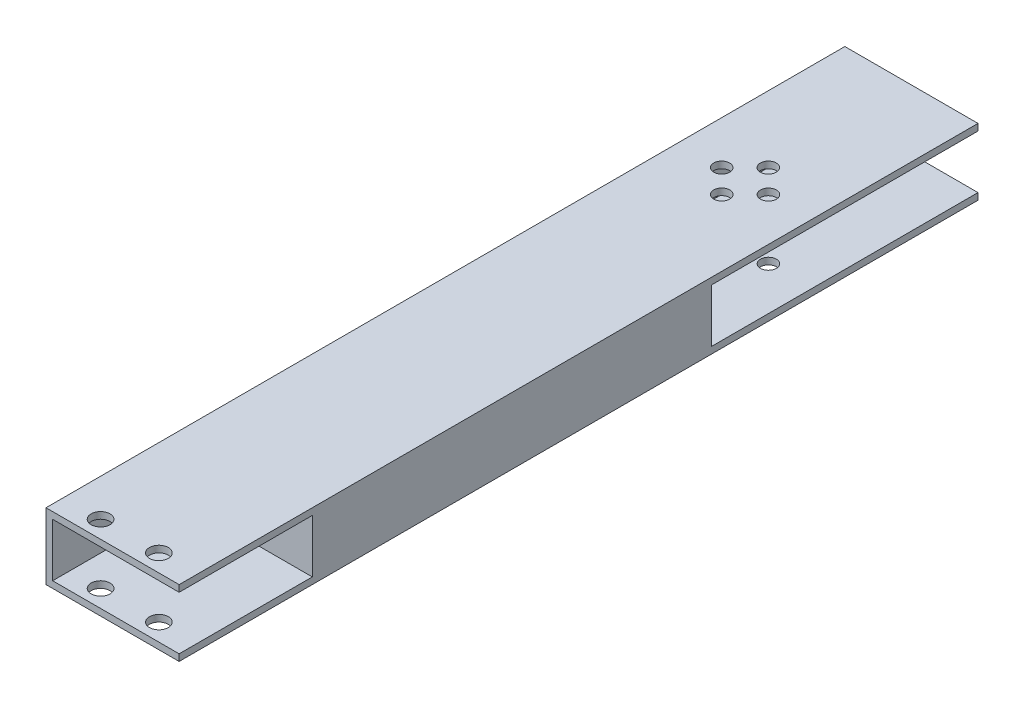
ISO-10303-21;
HEADER;
FILE_DESCRIPTION(('STEP AP214'),'2;1');
FILE_NAME('part.step','',(''),(''),'','','');
FILE_SCHEMA(('AUTOMOTIVE_DESIGN { 1 0 10303 214 1 1 1 1 }'));
ENDSEC;
DATA;
#1=APPLICATION_CONTEXT('core data for automotive mechanical design processes');
#2=APPLICATION_PROTOCOL_DEFINITION('international standard','automotive_design',2000,#1);
#3=PRODUCT_CONTEXT('',#1,'mechanical');
#4=PRODUCT('Part','Part','',(#3));
#5=PRODUCT_RELATED_PRODUCT_CATEGORY('part','',(#4));
#6=PRODUCT_DEFINITION_FORMATION('','',#4);
#7=PRODUCT_DEFINITION_CONTEXT('part definition',#1,'design');
#8=PRODUCT_DEFINITION('design','',#6,#7);
#9=PRODUCT_DEFINITION_SHAPE('','',#8);
#10=(LENGTH_UNIT() NAMED_UNIT(*) SI_UNIT(.MILLI.,.METRE.));
#11=(NAMED_UNIT(*) PLANE_ANGLE_UNIT() SI_UNIT($,.RADIAN.));
#12=(NAMED_UNIT(*) SI_UNIT($,.STERADIAN.) SOLID_ANGLE_UNIT());
#13=UNCERTAINTY_MEASURE_WITH_UNIT(LENGTH_MEASURE(1.E-05),#10,'distance_accuracy_value','');
#14=(GEOMETRIC_REPRESENTATION_CONTEXT(3) GLOBAL_UNCERTAINTY_ASSIGNED_CONTEXT((#13)) GLOBAL_UNIT_ASSIGNED_CONTEXT((#10,
#11,#12)) REPRESENTATION_CONTEXT('',''));
#15=CARTESIAN_POINT('',(0.,0.,0.));
#16=DIRECTION('',(0.,0.,1.));
#17=DIRECTION('',(1.,0.,0.));
#18=AXIS2_PLACEMENT_3D('',#15,#16,#17);
#19=CARTESIAN_POINT('',(11.43,5.08,127.));
#20=DIRECTION('',(0.,1.,0.));
#21=DIRECTION('',(0.,0.,1.));
#22=AXIS2_PLACEMENT_3D('',#19,#20,#21);
#23=PLANE('',#22);
#24=CARTESIAN_POINT('',(-4.445,5.08,6.35));
#25=DIRECTION('',(0.,1.,0.));
#26=DIRECTION('',(0.,0.,1.));
#27=AXIS2_PLACEMENT_3D('',#24,#25,#26);
#28=CIRCLE('',#27,1.524);
#29=CARTESIAN_POINT('',(-4.445,5.08,7.874));
#30=VERTEX_POINT('',#29);
#31=EDGE_CURVE('E237',#30,#30,#28,.T.);
#32=ORIENTED_EDGE('',*,*,#31,.T.);
#33=EDGE_LOOP('',(#32));
#34=FACE_BOUND('',#33,.T.);
#35=CARTESIAN_POINT('',(0.,5.08,10.795));
#36=DIRECTION('',(0.,1.,0.));
#37=DIRECTION('',(0.,0.,1.));
#38=AXIS2_PLACEMENT_3D('',#35,#36,#37);
#39=CIRCLE('',#38,1.524);
#40=CARTESIAN_POINT('',(0.,5.08,12.319));
#41=VERTEX_POINT('',#40);
#42=EDGE_CURVE('E242',#41,#41,#39,.T.);
#43=ORIENTED_EDGE('',*,*,#42,.T.);
#44=EDGE_LOOP('',(#43));
#45=FACE_BOUND('',#44,.T.);
#46=CARTESIAN_POINT('',(4.4704,5.08,6.35));
#47=DIRECTION('',(0.,1.,0.));
#48=DIRECTION('',(0.,0.,1.));
#49=AXIS2_PLACEMENT_3D('',#46,#47,#48);
#50=CIRCLE('',#49,1.524);
#51=CARTESIAN_POINT('',(4.4704,5.08,7.874));
#52=VERTEX_POINT('',#51);
#53=EDGE_CURVE('E247',#52,#52,#50,.T.);
#54=ORIENTED_EDGE('',*,*,#53,.T.);
#55=EDGE_LOOP('',(#54));
#56=FACE_BOUND('',#55,.T.);
#57=CARTESIAN_POINT('',(0.,5.08,1.905));
#58=DIRECTION('',(0.,1.,0.));
#59=DIRECTION('',(0.,0.,1.));
#60=AXIS2_PLACEMENT_3D('',#57,#58,#59);
#61=CIRCLE('',#60,1.524);
#62=CARTESIAN_POINT('',(0.,5.08,3.429));
#63=VERTEX_POINT('',#62);
#64=EDGE_CURVE('E251',#63,#63,#61,.T.);
#65=ORIENTED_EDGE('',*,*,#64,.T.);
#66=EDGE_LOOP('',(#65));
#67=FACE_BOUND('',#66,.T.);
#68=DIRECTION('',(1.,0.,0.));
#69=VECTOR('',#68,1.);
#70=CARTESIAN_POINT('',(-11.43,5.08,25.4));
#71=LINE('',#70,#69);
#72=CARTESIAN_POINT('',(-11.43,5.08,25.4));
#73=VERTEX_POINT('',#72);
#74=CARTESIAN_POINT('',(12.7,5.08,25.4));
#75=VERTEX_POINT('',#74);
#76=EDGE_CURVE('E158',#73,#75,#71,.T.);
#77=ORIENTED_EDGE('',*,*,#76,.F.);
#78=DIRECTION('',(0.,0.,-1.));
#79=VECTOR('',#78,1.);
#80=CARTESIAN_POINT('',(-11.43,5.08,127.));
#81=LINE('',#80,#79);
#82=CARTESIAN_POINT('',(-11.43,5.08,-25.4));
#83=VERTEX_POINT('',#82);
#84=EDGE_CURVE('E154',#73,#83,#81,.T.);
#85=ORIENTED_EDGE('',*,*,#84,.T.);
#86=DIRECTION('',(1.,0.,0.));
#87=VECTOR('',#86,1.);
#88=CARTESIAN_POINT('',(11.43,5.08,-25.4));
#89=LINE('',#88,#87);
#90=CARTESIAN_POINT('',(12.7,5.08,-25.4));
#91=VERTEX_POINT('',#90);
#92=EDGE_CURVE('E184',#83,#91,#89,.T.);
#93=ORIENTED_EDGE('',*,*,#92,.T.);
#94=DIRECTION('',(0.,0.,-1.));
#95=VECTOR('',#94,1.);
#96=CARTESIAN_POINT('',(12.7,5.08,127.001));
#97=LINE('',#96,#95);
#98=EDGE_CURVE('E61',#75,#91,#97,.T.);
#99=ORIENTED_EDGE('',*,*,#98,.F.);
#100=EDGE_LOOP('',(#77,#85,#93,#99));
#101=FACE_BOUND('',#100,.T.);
#102=ADVANCED_FACE('F43',(#34,#45,#56,#67,#101),#23,.F.);
#103=CARTESIAN_POINT('',(-11.43,5.08,127.));
#104=DIRECTION('',(-1.,0.,0.));
#105=DIRECTION('',(0.,-1.,0.));
#106=AXIS2_PLACEMENT_3D('',#103,#104,#105);
#107=PLANE('',#106);
#108=DIRECTION('',(0.,1.,0.));
#109=VECTOR('',#108,1.);
#110=CARTESIAN_POINT('',(-11.43,5.08,25.4));
#111=LINE('',#110,#109);
#112=CARTESIAN_POINT('',(-11.43,-5.08,25.4));
#113=VERTEX_POINT('',#112);
#114=EDGE_CURVE('E152',#113,#73,#111,.T.);
#115=ORIENTED_EDGE('',*,*,#114,.F.);
#116=DIRECTION('',(0.,0.,-1.));
#117=VECTOR('',#116,1.);
#118=CARTESIAN_POINT('',(-11.43,-5.08,127.));
#119=LINE('',#118,#117);
#120=CARTESIAN_POINT('',(-11.43,-5.08,-25.4));
#121=VERTEX_POINT('',#120);
#122=EDGE_CURVE('E135',#113,#121,#119,.T.);
#123=ORIENTED_EDGE('',*,*,#122,.T.);
#124=DIRECTION('',(0.,1.,0.));
#125=VECTOR('',#124,1.);
#126=CARTESIAN_POINT('',(-11.43,5.08,-25.4));
#127=LINE('',#126,#125);
#128=EDGE_CURVE('E181',#121,#83,#127,.T.);
#129=ORIENTED_EDGE('',*,*,#128,.T.);
#130=ORIENTED_EDGE('',*,*,#84,.F.);
#131=EDGE_LOOP('',(#115,#123,#129,#130));
#132=FACE_BOUND('',#131,.T.);
#133=ADVANCED_FACE('F153',(#132),#107,.F.);
#134=CARTESIAN_POINT('',(11.43,-5.08,127.));
#135=DIRECTION('',(0.,-1.,0.));
#136=DIRECTION('',(0.,0.,-1.));
#137=AXIS2_PLACEMENT_3D('',#134,#135,#136);
#138=PLANE('',#137);
#139=CARTESIAN_POINT('',(-4.445,-5.08,6.35));
#140=DIRECTION('',(0.,-1.,0.));
#141=DIRECTION('',(0.,0.,-1.));
#142=AXIS2_PLACEMENT_3D('',#139,#140,#141);
#143=CIRCLE('',#142,1.524);
#144=CARTESIAN_POINT('',(-4.445,-5.08,4.826));
#145=VERTEX_POINT('',#144);
#146=EDGE_CURVE('E209',#145,#145,#143,.T.);
#147=ORIENTED_EDGE('',*,*,#146,.T.);
#148=EDGE_LOOP('',(#147));
#149=FACE_BOUND('',#148,.T.);
#150=CARTESIAN_POINT('',(0.,-5.08,10.795));
#151=DIRECTION('',(0.,-1.,0.));
#152=DIRECTION('',(0.,0.,-1.));
#153=AXIS2_PLACEMENT_3D('',#150,#151,#152);
#154=CIRCLE('',#153,1.524);
#155=CARTESIAN_POINT('',(0.,-5.08,9.271));
#156=VERTEX_POINT('',#155);
#157=EDGE_CURVE('E241',#156,#156,#154,.T.);
#158=ORIENTED_EDGE('',*,*,#157,.T.);
#159=EDGE_LOOP('',(#158));
#160=FACE_BOUND('',#159,.T.);
#161=CARTESIAN_POINT('',(4.4704,-5.08,6.35));
#162=DIRECTION('',(0.,-1.,0.));
#163=DIRECTION('',(0.,0.,-1.));
#164=AXIS2_PLACEMENT_3D('',#161,#162,#163);
#165=CIRCLE('',#164,1.524);
#166=CARTESIAN_POINT('',(4.4704,-5.08,4.826));
#167=VERTEX_POINT('',#166);
#168=EDGE_CURVE('E246',#167,#167,#165,.T.);
#169=ORIENTED_EDGE('',*,*,#168,.T.);
#170=EDGE_LOOP('',(#169));
#171=FACE_BOUND('',#170,.T.);
#172=CARTESIAN_POINT('',(0.,-5.08,1.905));
#173=DIRECTION('',(0.,-1.,0.));
#174=DIRECTION('',(0.,0.,-1.));
#175=AXIS2_PLACEMENT_3D('',#172,#173,#174);
#176=CIRCLE('',#175,1.524);
#177=CARTESIAN_POINT('',(0.,-5.08,0.381000000000001));
#178=VERTEX_POINT('',#177);
#179=EDGE_CURVE('E47',#178,#178,#176,.T.);
#180=ORIENTED_EDGE('',*,*,#179,.T.);
#181=EDGE_LOOP('',(#180));
#182=FACE_BOUND('',#181,.T.);
#183=DIRECTION('',(-1.,0.,0.));
#184=VECTOR('',#183,1.);
#185=CARTESIAN_POINT('',(-11.43,-5.08,25.4));
#186=LINE('',#185,#184);
#187=CARTESIAN_POINT('',(12.7,-5.08,25.4));
#188=VERTEX_POINT('',#187);
#189=EDGE_CURVE('E139',#188,#113,#186,.T.);
#190=ORIENTED_EDGE('',*,*,#189,.F.);
#191=DIRECTION('',(0.,0.,-1.));
#192=VECTOR('',#191,1.);
#193=CARTESIAN_POINT('',(12.7,-5.08,127.001));
#194=LINE('',#193,#192);
#195=CARTESIAN_POINT('',(12.7,-5.08,-25.4));
#196=VERTEX_POINT('',#195);
#197=EDGE_CURVE('E175',#188,#196,#194,.T.);
#198=ORIENTED_EDGE('',*,*,#197,.T.);
#199=DIRECTION('',(-1.,0.,0.));
#200=VECTOR('',#199,1.);
#201=CARTESIAN_POINT('',(11.43,-5.08,-25.4));
#202=LINE('',#201,#200);
#203=EDGE_CURVE('E142',#196,#121,#202,.T.);
#204=ORIENTED_EDGE('',*,*,#203,.T.);
#205=ORIENTED_EDGE('',*,*,#122,.F.);
#206=EDGE_LOOP('',(#190,#198,#204,#205));
#207=FACE_BOUND('',#206,.T.);
#208=ADVANCED_FACE('F137',(#149,#160,#171,#182,#207),#138,.F.);
#209=CARTESIAN_POINT('',(-12.7,6.35,127.));
#210=DIRECTION('',(1.,0.,0.));
#211=DIRECTION('',(0.,0.,-1.));
#212=AXIS2_PLACEMENT_3D('',#209,#210,#211);
#213=PLANE('',#212);
#214=DIRECTION('',(0.,0.,-1.));
#215=VECTOR('',#214,1.);
#216=CARTESIAN_POINT('',(-12.7,6.35,127.));
#217=LINE('',#216,#215);
#218=CARTESIAN_POINT('',(-12.7,6.35,127.));
#219=VERTEX_POINT('',#218);
#220=CARTESIAN_POINT('',(-12.7,6.35,-25.4));
#221=VERTEX_POINT('',#220);
#222=EDGE_CURVE('E311',#219,#221,#217,.T.);
#223=ORIENTED_EDGE('',*,*,#222,.T.);
#224=DIRECTION('',(0.,1.,0.));
#225=VECTOR('',#224,1.);
#226=CARTESIAN_POINT('',(-12.7,6.35,-25.4));
#227=LINE('',#226,#225);
#228=CARTESIAN_POINT('',(-12.7,-6.35,-25.4));
#229=VERTEX_POINT('',#228);
#230=EDGE_CURVE('E196',#229,#221,#227,.T.);
#231=ORIENTED_EDGE('',*,*,#230,.F.);
#232=DIRECTION('',(0.,0.,-1.));
#233=VECTOR('',#232,1.);
#234=CARTESIAN_POINT('',(-12.7,-6.35,127.));
#235=LINE('',#234,#233);
#236=CARTESIAN_POINT('',(-12.7,-6.35,127.));
#237=VERTEX_POINT('',#236);
#238=EDGE_CURVE('E11',#237,#229,#235,.T.);
#239=ORIENTED_EDGE('',*,*,#238,.F.);
#240=DIRECTION('',(0.,-1.,0.));
#241=VECTOR('',#240,1.);
#242=CARTESIAN_POINT('',(-12.7,6.35,127.));
#243=LINE('',#242,#241);
#244=EDGE_CURVE('E293',#219,#237,#243,.T.);
#245=ORIENTED_EDGE('',*,*,#244,.F.);
#246=EDGE_LOOP('',(#223,#231,#239,#245));
#247=FACE_BOUND('',#246,.T.);
#248=ADVANCED_FACE('F45',(#247),#213,.F.);
#249=CARTESIAN_POINT('',(-12.7,-6.35,127.));
#250=DIRECTION('',(0.,1.,0.));
#251=DIRECTION('',(0.,0.,1.));
#252=AXIS2_PLACEMENT_3D('',#249,#250,#251);
#253=PLANE('',#252);
#254=CARTESIAN_POINT('',(0.,-6.35,1.905));
#255=DIRECTION('',(0.,-1.,0.));
#256=DIRECTION('',(0.,0.,-1.));
#257=AXIS2_PLACEMENT_3D('',#254,#255,#256);
#258=CIRCLE('',#257,1.524);
#259=CARTESIAN_POINT('',(0.,-6.35,0.381000000000001));
#260=VERTEX_POINT('',#259);
#261=EDGE_CURVE('E210',#260,#260,#258,.T.);
#262=ORIENTED_EDGE('',*,*,#261,.F.);
#263=EDGE_LOOP('',(#262));
#264=FACE_BOUND('',#263,.T.);
#265=CARTESIAN_POINT('',(4.4704,-6.35,6.35));
#266=DIRECTION('',(0.,-1.,0.));
#267=DIRECTION('',(0.,0.,-1.));
#268=AXIS2_PLACEMENT_3D('',#265,#266,#267);
#269=CIRCLE('',#268,1.524);
#270=CARTESIAN_POINT('',(4.4704,-6.35,4.826));
#271=VERTEX_POINT('',#270);
#272=EDGE_CURVE('E214',#271,#271,#269,.T.);
#273=ORIENTED_EDGE('',*,*,#272,.F.);
#274=EDGE_LOOP('',(#273));
#275=FACE_BOUND('',#274,.T.);
#276=CARTESIAN_POINT('',(0.,-6.35,10.795));
#277=DIRECTION('',(0.,-1.,0.));
#278=DIRECTION('',(0.,0.,-1.));
#279=AXIS2_PLACEMENT_3D('',#276,#277,#278);
#280=CIRCLE('',#279,1.524);
#281=CARTESIAN_POINT('',(0.,-6.35,9.271));
#282=VERTEX_POINT('',#281);
#283=EDGE_CURVE('E222',#282,#282,#280,.T.);
#284=ORIENTED_EDGE('',*,*,#283,.F.);
#285=EDGE_LOOP('',(#284));
#286=FACE_BOUND('',#285,.T.);
#287=CARTESIAN_POINT('',(-4.445,-6.35,6.35));
#288=DIRECTION('',(0.,-1.,0.));
#289=DIRECTION('',(0.,0.,-1.));
#290=AXIS2_PLACEMENT_3D('',#287,#288,#289);
#291=CIRCLE('',#290,1.524);
#292=CARTESIAN_POINT('',(-4.445,-6.35,4.826));
#293=VERTEX_POINT('',#292);
#294=EDGE_CURVE('E230',#293,#293,#291,.T.);
#295=ORIENTED_EDGE('',*,*,#294,.F.);
#296=EDGE_LOOP('',(#295));
#297=FACE_BOUND('',#296,.T.);
#298=CARTESIAN_POINT('',(-5.588,-6.35,123.698));
#299=DIRECTION('',(0.,1.,0.));
#300=DIRECTION('',(0.,0.,1.));
#301=AXIS2_PLACEMENT_3D('',#298,#299,#300);
#302=CIRCLE('',#301,1.80339999999999);
#303=CARTESIAN_POINT('',(-5.588,-6.35,125.5014));
#304=VERTEX_POINT('',#303);
#305=EDGE_CURVE('E256',#304,#304,#302,.T.);
#306=ORIENTED_EDGE('',*,*,#305,.T.);
#307=EDGE_LOOP('',(#306));
#308=FACE_BOUND('',#307,.T.);
#309=CARTESIAN_POINT('',(5.5372,-6.35,123.698));
#310=DIRECTION('',(0.,1.,0.));
#311=DIRECTION('',(0.,0.,1.));
#312=AXIS2_PLACEMENT_3D('',#309,#310,#311);
#313=CIRCLE('',#312,1.80339999999999);
#314=CARTESIAN_POINT('',(5.5372,-6.35,125.5014));
#315=VERTEX_POINT('',#314);
#316=EDGE_CURVE('E255',#315,#315,#313,.T.);
#317=ORIENTED_EDGE('',*,*,#316,.T.);
#318=EDGE_LOOP('',(#317));
#319=FACE_BOUND('',#318,.T.);
#320=ORIENTED_EDGE('',*,*,#238,.T.);
#321=DIRECTION('',(-1.,0.,0.));
#322=VECTOR('',#321,1.);
#323=CARTESIAN_POINT('',(12.7,-6.35,-25.4));
#324=LINE('',#323,#322);
#325=CARTESIAN_POINT('',(12.7,-6.35,-25.4));
#326=VERTEX_POINT('',#325);
#327=EDGE_CURVE('E192',#326,#229,#324,.T.);
#328=ORIENTED_EDGE('',*,*,#327,.F.);
#329=DIRECTION('',(0.,0.,-1.));
#330=VECTOR('',#329,1.);
#331=CARTESIAN_POINT('',(12.7,-6.35,127.));
#332=LINE('',#331,#330);
#333=CARTESIAN_POINT('',(12.7,-6.35,127.));
#334=VERTEX_POINT('',#333);
#335=EDGE_CURVE('E53',#334,#326,#332,.T.);
#336=ORIENTED_EDGE('',*,*,#335,.F.);
#337=DIRECTION('',(1.,0.,0.));
#338=VECTOR('',#337,1.);
#339=CARTESIAN_POINT('',(-12.7,-6.35,127.));
#340=LINE('',#339,#338);
#341=EDGE_CURVE('E300',#237,#334,#340,.T.);
#342=ORIENTED_EDGE('',*,*,#341,.F.);
#343=EDGE_LOOP('',(#320,#328,#336,#342));
#344=FACE_BOUND('',#343,.T.);
#345=ADVANCED_FACE('F425',(#264,#275,#286,#297,#308,#319,#344),#253,.F.);
#346=CARTESIAN_POINT('',(12.7,6.35,127.));
#347=DIRECTION('',(-1.,0.,0.));
#348=DIRECTION('',(0.,0.,1.));
#349=AXIS2_PLACEMENT_3D('',#346,#347,#348);
#350=PLANE('',#349);
#351=DIRECTION('',(0.,1.,0.));
#352=VECTOR('',#351,1.);
#353=CARTESIAN_POINT('',(12.7,6.35,127.));
#354=LINE('',#353,#352);
#355=CARTESIAN_POINT('',(12.7,5.08,127.));
#356=VERTEX_POINT('',#355);
#357=CARTESIAN_POINT('',(12.7,6.35,127.));
#358=VERTEX_POINT('',#357);
#359=EDGE_CURVE('E303',#356,#358,#354,.T.);
#360=ORIENTED_EDGE('',*,*,#359,.F.);
#361=CARTESIAN_POINT('',(12.7,5.08,101.6));
#362=VERTEX_POINT('',#361);
#363=EDGE_CURVE('E176',#356,#362,#97,.T.);
#364=ORIENTED_EDGE('',*,*,#363,.T.);
#365=DIRECTION('',(0.,-1.,0.));
#366=VECTOR('',#365,1.);
#367=CARTESIAN_POINT('',(12.7,5.08,101.6));
#368=LINE('',#367,#366);
#369=CARTESIAN_POINT('',(12.7,-5.08,101.6));
#370=VERTEX_POINT('',#369);
#371=EDGE_CURVE('E395',#362,#370,#368,.T.);
#372=ORIENTED_EDGE('',*,*,#371,.T.);
#373=CARTESIAN_POINT('',(12.7,-5.08,127.));
#374=VERTEX_POINT('',#373);
#375=EDGE_CURVE('E172',#374,#370,#194,.T.);
#376=ORIENTED_EDGE('',*,*,#375,.F.);
#377=EDGE_CURVE('E304',#334,#374,#354,.T.);
#378=ORIENTED_EDGE('',*,*,#377,.F.);
#379=ORIENTED_EDGE('',*,*,#335,.T.);
#380=DIRECTION('',(0.,-1.,0.));
#381=VECTOR('',#380,1.);
#382=CARTESIAN_POINT('',(12.7,6.35,-25.4));
#383=LINE('',#382,#381);
#384=EDGE_CURVE('E187',#196,#326,#383,.T.);
#385=ORIENTED_EDGE('',*,*,#384,.F.);
#386=ORIENTED_EDGE('',*,*,#197,.F.);
#387=DIRECTION('',(0.,-1.,0.));
#388=VECTOR('',#387,1.);
#389=CARTESIAN_POINT('',(12.7,5.08,25.4));
#390=LINE('',#389,#388);
#391=EDGE_CURVE('E162',#75,#188,#390,.T.);
#392=ORIENTED_EDGE('',*,*,#391,.F.);
#393=ORIENTED_EDGE('',*,*,#98,.T.);
#394=CARTESIAN_POINT('',(12.7,6.35,-25.4));
#395=VERTEX_POINT('',#394);
#396=EDGE_CURVE('E188',#395,#91,#383,.T.);
#397=ORIENTED_EDGE('',*,*,#396,.F.);
#398=DIRECTION('',(0.,0.,-1.));
#399=VECTOR('',#398,1.);
#400=CARTESIAN_POINT('',(12.7,6.35,127.));
#401=LINE('',#400,#399);
#402=EDGE_CURVE('E314',#358,#395,#401,.T.);
#403=ORIENTED_EDGE('',*,*,#402,.F.);
#404=EDGE_LOOP('',(#360,#364,#372,#376,#378,#379,#385,#386,#392,#393,#397,#403));
#405=FACE_BOUND('',#404,.T.);
#406=ADVANCED_FACE('F413',(#405),#350,.F.);
#407=CARTESIAN_POINT('',(-12.7,6.35,127.));
#408=DIRECTION('',(0.,-1.,0.));
#409=DIRECTION('',(0.,0.,-1.));
#410=AXIS2_PLACEMENT_3D('',#407,#408,#409);
#411=PLANE('',#410);
#412=CARTESIAN_POINT('',(0.,6.35,1.905));
#413=DIRECTION('',(0.,-1.,0.));
#414=DIRECTION('',(0.,0.,-1.));
#415=AXIS2_PLACEMENT_3D('',#412,#413,#414);
#416=CIRCLE('',#415,1.524);
#417=CARTESIAN_POINT('',(0.,6.35,0.381000000000001));
#418=VERTEX_POINT('',#417);
#419=EDGE_CURVE('E205',#418,#418,#416,.T.);
#420=ORIENTED_EDGE('',*,*,#419,.T.);
#421=EDGE_LOOP('',(#420));
#422=FACE_BOUND('',#421,.T.);
#423=CARTESIAN_POINT('',(4.4704,6.35,6.35));
#424=DIRECTION('',(0.,-1.,0.));
#425=DIRECTION('',(0.,0.,-1.));
#426=AXIS2_PLACEMENT_3D('',#423,#424,#425);
#427=CIRCLE('',#426,1.524);
#428=CARTESIAN_POINT('',(4.4704,6.35,4.826));
#429=VERTEX_POINT('',#428);
#430=EDGE_CURVE('E218',#429,#429,#427,.T.);
#431=ORIENTED_EDGE('',*,*,#430,.T.);
#432=EDGE_LOOP('',(#431));
#433=FACE_BOUND('',#432,.T.);
#434=CARTESIAN_POINT('',(0.,6.35,10.795));
#435=DIRECTION('',(0.,-1.,0.));
#436=DIRECTION('',(0.,0.,-1.));
#437=AXIS2_PLACEMENT_3D('',#434,#435,#436);
#438=CIRCLE('',#437,1.524);
#439=CARTESIAN_POINT('',(0.,6.35,9.271));
#440=VERTEX_POINT('',#439);
#441=EDGE_CURVE('E226',#440,#440,#438,.T.);
#442=ORIENTED_EDGE('',*,*,#441,.T.);
#443=EDGE_LOOP('',(#442));
#444=FACE_BOUND('',#443,.T.);
#445=CARTESIAN_POINT('',(-4.445,6.35,6.35));
#446=DIRECTION('',(0.,-1.,0.));
#447=DIRECTION('',(0.,0.,-1.));
#448=AXIS2_PLACEMENT_3D('',#445,#446,#447);
#449=CIRCLE('',#448,1.524);
#450=CARTESIAN_POINT('',(-4.445,6.35,4.826));
#451=VERTEX_POINT('',#450);
#452=EDGE_CURVE('E204',#451,#451,#449,.T.);
#453=ORIENTED_EDGE('',*,*,#452,.T.);
#454=EDGE_LOOP('',(#453));
#455=FACE_BOUND('',#454,.T.);
#456=CARTESIAN_POINT('',(-5.588,6.35,123.698));
#457=DIRECTION('',(0.,-1.,0.));
#458=DIRECTION('',(0.,0.,-1.));
#459=AXIS2_PLACEMENT_3D('',#456,#457,#458);
#460=CIRCLE('',#459,1.80339999999999);
#461=CARTESIAN_POINT('',(-5.588,6.35,121.8946));
#462=VERTEX_POINT('',#461);
#463=EDGE_CURVE('E277',#462,#462,#460,.T.);
#464=ORIENTED_EDGE('',*,*,#463,.T.);
#465=EDGE_LOOP('',(#464));
#466=FACE_BOUND('',#465,.T.);
#467=CARTESIAN_POINT('',(5.5372,6.35,123.698));
#468=DIRECTION('',(0.,-1.,0.));
#469=DIRECTION('',(0.,0.,-1.));
#470=AXIS2_PLACEMENT_3D('',#467,#468,#469);
#471=CIRCLE('',#470,1.80339999999999);
#472=CARTESIAN_POINT('',(5.5372,6.35,121.8946));
#473=VERTEX_POINT('',#472);
#474=EDGE_CURVE('E268',#473,#473,#471,.T.);
#475=ORIENTED_EDGE('',*,*,#474,.T.);
#476=EDGE_LOOP('',(#475));
#477=FACE_BOUND('',#476,.T.);
#478=ORIENTED_EDGE('',*,*,#402,.T.);
#479=DIRECTION('',(1.,0.,0.));
#480=VECTOR('',#479,1.);
#481=CARTESIAN_POINT('',(12.7,6.35,-25.4));
#482=LINE('',#481,#480);
#483=EDGE_CURVE('E200',#221,#395,#482,.T.);
#484=ORIENTED_EDGE('',*,*,#483,.F.);
#485=ORIENTED_EDGE('',*,*,#222,.F.);
#486=DIRECTION('',(-1.,0.,0.));
#487=VECTOR('',#486,1.);
#488=CARTESIAN_POINT('',(-12.7,6.35,127.));
#489=LINE('',#488,#487);
#490=EDGE_CURVE('E308',#358,#219,#489,.T.);
#491=ORIENTED_EDGE('',*,*,#490,.F.);
#492=EDGE_LOOP('',(#478,#484,#485,#491));
#493=FACE_BOUND('',#492,.T.);
#494=ADVANCED_FACE('F382',(#422,#433,#444,#455,#466,#477,#493),#411,.F.);
#495=CARTESIAN_POINT('',(0.,0.,127.));
#496=DIRECTION('',(0.,0.,1.));
#497=DIRECTION('',(1.,0.,0.));
#498=AXIS2_PLACEMENT_3D('',#495,#496,#497);
#499=PLANE('',#498);
#500=ORIENTED_EDGE('',*,*,#377,.T.);
#501=DIRECTION('',(-1.,0.,0.));
#502=VECTOR('',#501,1.);
#503=CARTESIAN_POINT('',(11.43,-5.08,127.));
#504=LINE('',#503,#502);
#505=CARTESIAN_POINT('',(-11.43,-5.08,127.));
#506=VERTEX_POINT('',#505);
#507=EDGE_CURVE('E281',#374,#506,#504,.T.);
#508=ORIENTED_EDGE('',*,*,#507,.T.);
#509=DIRECTION('',(0.,1.,0.));
#510=VECTOR('',#509,1.);
#511=CARTESIAN_POINT('',(-11.43,5.08,127.));
#512=LINE('',#511,#510);
#513=CARTESIAN_POINT('',(-11.43,5.08,127.));
#514=VERTEX_POINT('',#513);
#515=EDGE_CURVE('E285',#506,#514,#512,.T.);
#516=ORIENTED_EDGE('',*,*,#515,.T.);
#517=DIRECTION('',(1.,0.,0.));
#518=VECTOR('',#517,1.);
#519=CARTESIAN_POINT('',(11.43,5.08,127.));
#520=LINE('',#519,#518);
#521=EDGE_CURVE('E148',#514,#356,#520,.T.);
#522=ORIENTED_EDGE('',*,*,#521,.T.);
#523=ORIENTED_EDGE('',*,*,#359,.T.);
#524=ORIENTED_EDGE('',*,*,#490,.T.);
#525=ORIENTED_EDGE('',*,*,#244,.T.);
#526=ORIENTED_EDGE('',*,*,#341,.T.);
#527=EDGE_LOOP('',(#500,#508,#516,#522,#523,#524,#525,#526));
#528=FACE_BOUND('',#527,.T.);
#529=ADVANCED_FACE('F372',(#528),#499,.T.);
#530=CARTESIAN_POINT('',(-5.588,5.08,123.698));
#531=DIRECTION('',(0.,1.,0.));
#532=DIRECTION('',(0.,0.,1.));
#533=AXIS2_PLACEMENT_3D('',#530,#531,#532);
#534=CIRCLE('',#533,1.80339999999999);
#535=CARTESIAN_POINT('',(-5.588,5.08,125.5014));
#536=VERTEX_POINT('',#535);
#537=EDGE_CURVE('E273',#536,#536,#534,.T.);
#538=ORIENTED_EDGE('',*,*,#537,.T.);
#539=EDGE_LOOP('',(#538));
#540=FACE_BOUND('',#539,.T.);
#541=CARTESIAN_POINT('',(5.5372,5.08,123.698));
#542=DIRECTION('',(0.,1.,0.));
#543=DIRECTION('',(0.,0.,1.));
#544=AXIS2_PLACEMENT_3D('',#541,#542,#543);
#545=CIRCLE('',#544,1.80339999999999);
#546=CARTESIAN_POINT('',(5.5372,5.08,125.5014));
#547=VERTEX_POINT('',#546);
#548=EDGE_CURVE('E264',#547,#547,#545,.T.);
#549=ORIENTED_EDGE('',*,*,#548,.T.);
#550=EDGE_LOOP('',(#549));
#551=FACE_BOUND('',#550,.T.);
#552=CARTESIAN_POINT('',(-11.43,5.08,101.6));
#553=VERTEX_POINT('',#552);
#554=EDGE_CURVE('E291',#514,#553,#81,.T.);
#555=ORIENTED_EDGE('',*,*,#554,.T.);
#556=DIRECTION('',(1.,0.,0.));
#557=VECTOR('',#556,1.);
#558=CARTESIAN_POINT('',(-11.43,5.08,101.6));
#559=LINE('',#558,#557);
#560=EDGE_CURVE('E69',#553,#362,#559,.T.);
#561=ORIENTED_EDGE('',*,*,#560,.T.);
#562=ORIENTED_EDGE('',*,*,#363,.F.);
#563=ORIENTED_EDGE('',*,*,#521,.F.);
#564=EDGE_LOOP('',(#555,#561,#562,#563));
#565=FACE_BOUND('',#564,.T.);
#566=ADVANCED_FACE('F361',(#540,#551,#565),#23,.F.);
#567=CARTESIAN_POINT('',(-11.43,-5.08,101.6));
#568=VERTEX_POINT('',#567);
#569=EDGE_CURVE('E147',#506,#568,#119,.T.);
#570=ORIENTED_EDGE('',*,*,#569,.T.);
#571=DIRECTION('',(0.,1.,0.));
#572=VECTOR('',#571,1.);
#573=CARTESIAN_POINT('',(-11.43,5.08,101.6));
#574=LINE('',#573,#572);
#575=EDGE_CURVE('E164',#568,#553,#574,.T.);
#576=ORIENTED_EDGE('',*,*,#575,.T.);
#577=ORIENTED_EDGE('',*,*,#554,.F.);
#578=ORIENTED_EDGE('',*,*,#515,.F.);
#579=EDGE_LOOP('',(#570,#576,#577,#578));
#580=FACE_BOUND('',#579,.T.);
#581=ADVANCED_FACE('F368',(#580),#107,.F.);
#582=CARTESIAN_POINT('',(-5.588,-5.08,123.698));
#583=DIRECTION('',(0.,-1.,0.));
#584=DIRECTION('',(0.,0.,-1.));
#585=AXIS2_PLACEMENT_3D('',#582,#583,#584);
#586=CIRCLE('',#585,1.80339999999999);
#587=CARTESIAN_POINT('',(-5.588,-5.08,121.8946));
#588=VERTEX_POINT('',#587);
#589=EDGE_CURVE('E272',#588,#588,#586,.T.);
#590=ORIENTED_EDGE('',*,*,#589,.T.);
#591=EDGE_LOOP('',(#590));
#592=FACE_BOUND('',#591,.T.);
#593=CARTESIAN_POINT('',(5.5372,-5.08,123.698));
#594=DIRECTION('',(0.,-1.,0.));
#595=DIRECTION('',(0.,0.,-1.));
#596=AXIS2_PLACEMENT_3D('',#593,#594,#595);
#597=CIRCLE('',#596,1.80339999999999);
#598=CARTESIAN_POINT('',(5.5372,-5.08,121.8946));
#599=VERTEX_POINT('',#598);
#600=EDGE_CURVE('E260',#599,#599,#597,.T.);
#601=ORIENTED_EDGE('',*,*,#600,.T.);
#602=EDGE_LOOP('',(#601));
#603=FACE_BOUND('',#602,.T.);
#604=ORIENTED_EDGE('',*,*,#375,.T.);
#605=DIRECTION('',(-1.,0.,0.));
#606=VECTOR('',#605,1.);
#607=CARTESIAN_POINT('',(-11.43,-5.08,101.6));
#608=LINE('',#607,#606);
#609=EDGE_CURVE('E399',#370,#568,#608,.T.);
#610=ORIENTED_EDGE('',*,*,#609,.T.);
#611=ORIENTED_EDGE('',*,*,#569,.F.);
#612=ORIENTED_EDGE('',*,*,#507,.F.);
#613=EDGE_LOOP('',(#604,#610,#611,#612));
#614=FACE_BOUND('',#613,.T.);
#615=ADVANCED_FACE('F379',(#592,#603,#614),#138,.F.);
#616=CARTESIAN_POINT('',(5.5372,-6.35,123.698));
#617=DIRECTION('',(0.,1.,0.));
#618=DIRECTION('',(0.,0.,1.));
#619=AXIS2_PLACEMENT_3D('',#616,#617,#618);
#620=CYLINDRICAL_SURFACE('',#619,1.80339999999999);
#621=ORIENTED_EDGE('',*,*,#316,.F.);
#622=EDGE_LOOP('',(#621));
#623=FACE_BOUND('',#622,.T.);
#624=ORIENTED_EDGE('',*,*,#600,.F.);
#625=EDGE_LOOP('',(#624));
#626=FACE_BOUND('',#625,.T.);
#627=ADVANCED_FACE('F442',(#623,#626),#620,.F.);
#628=CARTESIAN_POINT('',(-5.588,-6.35,123.698));
#629=DIRECTION('',(0.,1.,0.));
#630=DIRECTION('',(0.,0.,1.));
#631=AXIS2_PLACEMENT_3D('',#628,#629,#630);
#632=CYLINDRICAL_SURFACE('',#631,1.80339999999999);
#633=ORIENTED_EDGE('',*,*,#305,.F.);
#634=EDGE_LOOP('',(#633));
#635=FACE_BOUND('',#634,.T.);
#636=ORIENTED_EDGE('',*,*,#589,.F.);
#637=EDGE_LOOP('',(#636));
#638=FACE_BOUND('',#637,.T.);
#639=ADVANCED_FACE('F448',(#635,#638),#632,.F.);
#640=ORIENTED_EDGE('',*,*,#548,.F.);
#641=EDGE_LOOP('',(#640));
#642=FACE_BOUND('',#641,.T.);
#643=ORIENTED_EDGE('',*,*,#474,.F.);
#644=EDGE_LOOP('',(#643));
#645=FACE_BOUND('',#644,.T.);
#646=ADVANCED_FACE('F450',(#642,#645),#620,.F.);
#647=ORIENTED_EDGE('',*,*,#537,.F.);
#648=EDGE_LOOP('',(#647));
#649=FACE_BOUND('',#648,.T.);
#650=ORIENTED_EDGE('',*,*,#463,.F.);
#651=EDGE_LOOP('',(#650));
#652=FACE_BOUND('',#651,.T.);
#653=ADVANCED_FACE('F461',(#649,#652),#632,.F.);
#654=CARTESIAN_POINT('',(-4.445,6.35,6.35));
#655=DIRECTION('',(0.,-1.,0.));
#656=DIRECTION('',(0.,0.,-1.));
#657=AXIS2_PLACEMENT_3D('',#654,#655,#656);
#658=CYLINDRICAL_SURFACE('',#657,1.524);
#659=ORIENTED_EDGE('',*,*,#294,.T.);
#660=EDGE_LOOP('',(#659));
#661=FACE_BOUND('',#660,.T.);
#662=ORIENTED_EDGE('',*,*,#146,.F.);
#663=EDGE_LOOP('',(#662));
#664=FACE_BOUND('',#663,.T.);
#665=ADVANCED_FACE('F352',(#661,#664),#658,.F.);
#666=CARTESIAN_POINT('',(0.,6.35,10.795));
#667=DIRECTION('',(0.,-1.,0.));
#668=DIRECTION('',(0.,0.,-1.));
#669=AXIS2_PLACEMENT_3D('',#666,#667,#668);
#670=CYLINDRICAL_SURFACE('',#669,1.524);
#671=ORIENTED_EDGE('',*,*,#283,.T.);
#672=EDGE_LOOP('',(#671));
#673=FACE_BOUND('',#672,.T.);
#674=ORIENTED_EDGE('',*,*,#157,.F.);
#675=EDGE_LOOP('',(#674));
#676=FACE_BOUND('',#675,.T.);
#677=ADVANCED_FACE('F340',(#673,#676),#670,.F.);
#678=CARTESIAN_POINT('',(4.4704,6.35,6.35));
#679=DIRECTION('',(0.,-1.,0.));
#680=DIRECTION('',(0.,0.,-1.));
#681=AXIS2_PLACEMENT_3D('',#678,#679,#680);
#682=CYLINDRICAL_SURFACE('',#681,1.524);
#683=ORIENTED_EDGE('',*,*,#272,.T.);
#684=EDGE_LOOP('',(#683));
#685=FACE_BOUND('',#684,.T.);
#686=ORIENTED_EDGE('',*,*,#168,.F.);
#687=EDGE_LOOP('',(#686));
#688=FACE_BOUND('',#687,.T.);
#689=ADVANCED_FACE('F337',(#685,#688),#682,.F.);
#690=CARTESIAN_POINT('',(0.,6.35,1.905));
#691=DIRECTION('',(0.,-1.,0.));
#692=DIRECTION('',(0.,0.,-1.));
#693=AXIS2_PLACEMENT_3D('',#690,#691,#692);
#694=CYLINDRICAL_SURFACE('',#693,1.524);
#695=ORIENTED_EDGE('',*,*,#261,.T.);
#696=EDGE_LOOP('',(#695));
#697=FACE_BOUND('',#696,.T.);
#698=ORIENTED_EDGE('',*,*,#179,.F.);
#699=EDGE_LOOP('',(#698));
#700=FACE_BOUND('',#699,.T.);
#701=ADVANCED_FACE('F339',(#697,#700),#694,.F.);
#702=ORIENTED_EDGE('',*,*,#452,.F.);
#703=EDGE_LOOP('',(#702));
#704=FACE_BOUND('',#703,.T.);
#705=ORIENTED_EDGE('',*,*,#31,.F.);
#706=EDGE_LOOP('',(#705));
#707=FACE_BOUND('',#706,.T.);
#708=ADVANCED_FACE('F348',(#704,#707),#658,.F.);
#709=ORIENTED_EDGE('',*,*,#441,.F.);
#710=EDGE_LOOP('',(#709));
#711=FACE_BOUND('',#710,.T.);
#712=ORIENTED_EDGE('',*,*,#42,.F.);
#713=EDGE_LOOP('',(#712));
#714=FACE_BOUND('',#713,.T.);
#715=ADVANCED_FACE('F355',(#711,#714),#670,.F.);
#716=ORIENTED_EDGE('',*,*,#430,.F.);
#717=EDGE_LOOP('',(#716));
#718=FACE_BOUND('',#717,.T.);
#719=ORIENTED_EDGE('',*,*,#53,.F.);
#720=EDGE_LOOP('',(#719));
#721=FACE_BOUND('',#720,.T.);
#722=ADVANCED_FACE('F343',(#718,#721),#682,.F.);
#723=ORIENTED_EDGE('',*,*,#419,.F.);
#724=EDGE_LOOP('',(#723));
#725=FACE_BOUND('',#724,.T.);
#726=ORIENTED_EDGE('',*,*,#64,.F.);
#727=EDGE_LOOP('',(#726));
#728=FACE_BOUND('',#727,.T.);
#729=ADVANCED_FACE('F351',(#725,#728),#694,.F.);
#730=CARTESIAN_POINT('',(0.,0.,-25.4));
#731=DIRECTION('',(0.,0.,-1.));
#732=DIRECTION('',(-1.,0.,0.));
#733=AXIS2_PLACEMENT_3D('',#730,#731,#732);
#734=PLANE('',#733);
#735=ORIENTED_EDGE('',*,*,#203,.F.);
#736=ORIENTED_EDGE('',*,*,#384,.T.);
#737=ORIENTED_EDGE('',*,*,#327,.T.);
#738=ORIENTED_EDGE('',*,*,#230,.T.);
#739=ORIENTED_EDGE('',*,*,#483,.T.);
#740=ORIENTED_EDGE('',*,*,#396,.T.);
#741=ORIENTED_EDGE('',*,*,#92,.F.);
#742=ORIENTED_EDGE('',*,*,#128,.F.);
#743=EDGE_LOOP('',(#735,#736,#737,#738,#739,#740,#741,#742));
#744=FACE_BOUND('',#743,.T.);
#745=ADVANCED_FACE('F407',(#744),#734,.T.);
#746=CARTESIAN_POINT('',(0.,0.,101.6));
#747=DIRECTION('',(0.,0.,1.));
#748=DIRECTION('',(1.,0.,0.));
#749=AXIS2_PLACEMENT_3D('',#746,#747,#748);
#750=PLANE('',#749);
#751=ORIENTED_EDGE('',*,*,#575,.F.);
#752=ORIENTED_EDGE('',*,*,#609,.F.);
#753=ORIENTED_EDGE('',*,*,#371,.F.);
#754=ORIENTED_EDGE('',*,*,#560,.F.);
#755=EDGE_LOOP('',(#751,#752,#753,#754));
#756=FACE_BOUND('',#755,.T.);
#757=ADVANCED_FACE('F392',(#756),#750,.T.);
#758=CARTESIAN_POINT('',(0.,0.,25.4));
#759=DIRECTION('',(0.,0.,1.));
#760=DIRECTION('',(1.,0.,0.));
#761=AXIS2_PLACEMENT_3D('',#758,#759,#760);
#762=PLANE('',#761);
#763=ORIENTED_EDGE('',*,*,#114,.T.);
#764=ORIENTED_EDGE('',*,*,#76,.T.);
#765=ORIENTED_EDGE('',*,*,#391,.T.);
#766=ORIENTED_EDGE('',*,*,#189,.T.);
#767=EDGE_LOOP('',(#763,#764,#765,#766));
#768=FACE_BOUND('',#767,.T.);
#769=ADVANCED_FACE('F161',(#768),#762,.F.);
#770=CLOSED_SHELL('',(#102,#133,#208,#248,#345,#406,#494,#529,#566,#581,#615,#627,#639,#646,
#653,#665,#677,#689,#701,#708,#715,#722,#729,#745,#757,#769));
#771=MANIFOLD_SOLID_BREP('B2',#770);
#772=ADVANCED_BREP_SHAPE_REPRESENTATION('',(#18,#771),#14);
#773=SHAPE_DEFINITION_REPRESENTATION(#9,#772);
ENDSEC;
END-ISO-10303-21;
